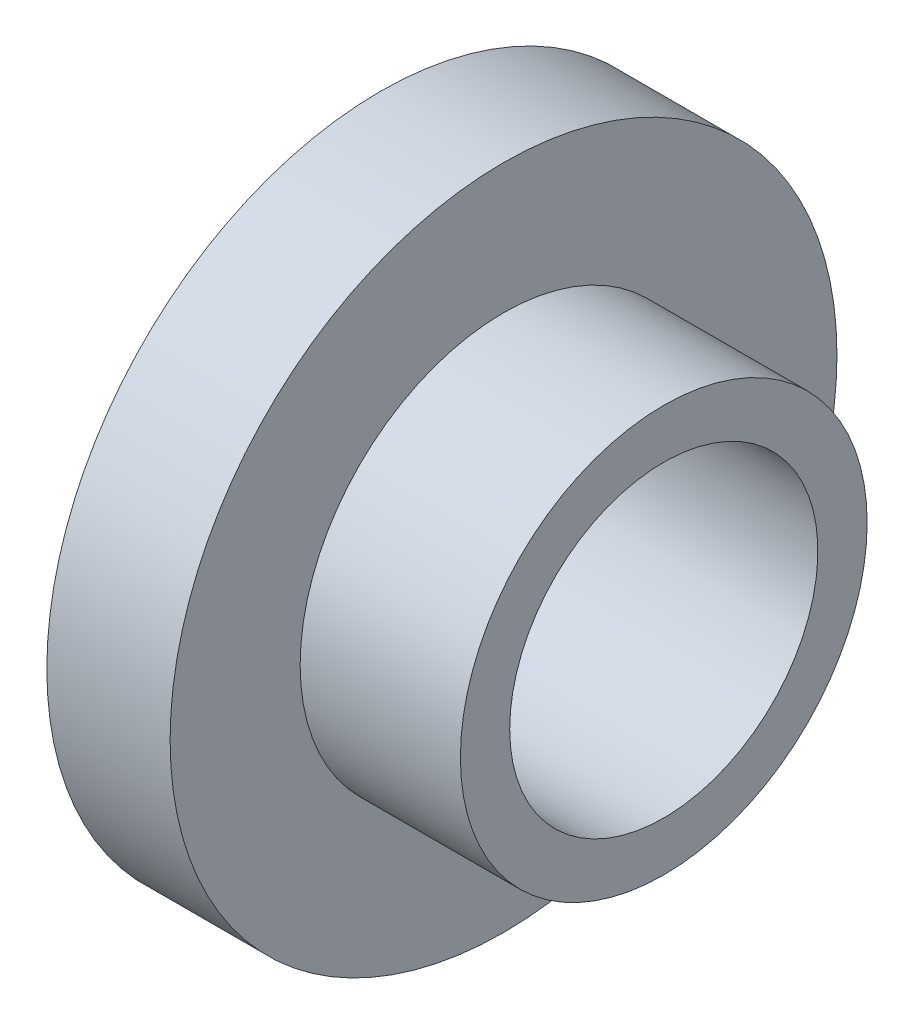
ISO-10303-21;
HEADER;
FILE_DESCRIPTION(('STEP AP214'),'2;1');
FILE_NAME('part.step','',(''),(''),'','','');
FILE_SCHEMA(('AUTOMOTIVE_DESIGN { 1 0 10303 214 1 1 1 1 }'));
ENDSEC;
DATA;
#1=APPLICATION_CONTEXT('core data for automotive mechanical design processes');
#2=APPLICATION_PROTOCOL_DEFINITION('international standard','automotive_design',2000,#1);
#3=PRODUCT_CONTEXT('',#1,'mechanical');
#4=PRODUCT('Part','Part','',(#3));
#5=PRODUCT_RELATED_PRODUCT_CATEGORY('part','',(#4));
#6=PRODUCT_DEFINITION_FORMATION('','',#4);
#7=PRODUCT_DEFINITION_CONTEXT('part definition',#1,'design');
#8=PRODUCT_DEFINITION('design','',#6,#7);
#9=PRODUCT_DEFINITION_SHAPE('','',#8);
#10=(LENGTH_UNIT() NAMED_UNIT(*) SI_UNIT(.MILLI.,.METRE.));
#11=(NAMED_UNIT(*) PLANE_ANGLE_UNIT() SI_UNIT($,.RADIAN.));
#12=(NAMED_UNIT(*) SI_UNIT($,.STERADIAN.) SOLID_ANGLE_UNIT());
#13=UNCERTAINTY_MEASURE_WITH_UNIT(LENGTH_MEASURE(1.E-05),#10,'distance_accuracy_value','');
#14=(GEOMETRIC_REPRESENTATION_CONTEXT(3) GLOBAL_UNCERTAINTY_ASSIGNED_CONTEXT((#13)) GLOBAL_UNIT_ASSIGNED_CONTEXT((#10,
#11,#12)) REPRESENTATION_CONTEXT('',''));
#15=CARTESIAN_POINT('',(0.,0.,0.));
#16=DIRECTION('',(0.,0.,1.));
#17=DIRECTION('',(1.,0.,0.));
#18=AXIS2_PLACEMENT_3D('',#15,#16,#17);
#19=CARTESIAN_POINT('',(5.,0.,0.));
#20=DIRECTION('',(-1.,0.,0.));
#21=DIRECTION('',(0.,0.,1.));
#22=AXIS2_PLACEMENT_3D('',#19,#20,#21);
#23=CYLINDRICAL_SURFACE('',#22,16.5);
#24=CARTESIAN_POINT('',(5.,0.,0.));
#25=DIRECTION('',(-1.,0.,0.));
#26=DIRECTION('',(0.,0.,1.));
#27=AXIS2_PLACEMENT_3D('',#24,#25,#26);
#28=CIRCLE('',#27,16.5);
#29=CARTESIAN_POINT('',(5.,0.,16.5));
#30=VERTEX_POINT('',#29);
#31=EDGE_CURVE('E38',#30,#30,#28,.T.);
#32=ORIENTED_EDGE('',*,*,#31,.F.);
#33=EDGE_LOOP('',(#32));
#34=FACE_BOUND('',#33,.T.);
#35=CARTESIAN_POINT('',(18.,0.,0.));
#36=DIRECTION('',(-1.,0.,0.));
#37=DIRECTION('',(0.,0.,1.));
#38=AXIS2_PLACEMENT_3D('',#35,#36,#37);
#39=CIRCLE('',#38,16.5);
#40=CARTESIAN_POINT('',(18.,0.,16.5));
#41=VERTEX_POINT('',#40);
#42=EDGE_CURVE('E16',#41,#41,#39,.F.);
#43=ORIENTED_EDGE('',*,*,#42,.F.);
#44=EDGE_LOOP('',(#43));
#45=FACE_BOUND('',#44,.T.);
#46=ADVANCED_FACE('F13',(#34,#45),#23,.T.);
#47=CARTESIAN_POINT('',(18.,16.5,16.6980021082497));
#48=DIRECTION('',(1.,0.,0.));
#49=DIRECTION('',(0.,-1.,0.));
#50=AXIS2_PLACEMENT_3D('',#47,#48,#49);
#51=PLANE('',#50);
#52=CARTESIAN_POINT('',(18.,0.,0.));
#53=DIRECTION('',(-1.,0.,0.));
#54=DIRECTION('',(0.,0.,1.));
#55=AXIS2_PLACEMENT_3D('',#52,#53,#54);
#56=CIRCLE('',#55,12.5);
#57=CARTESIAN_POINT('',(18.,0.,12.5));
#58=VERTEX_POINT('',#57);
#59=EDGE_CURVE('E36',#58,#58,#56,.F.);
#60=ORIENTED_EDGE('',*,*,#59,.F.);
#61=EDGE_LOOP('',(#60));
#62=FACE_BOUND('',#61,.T.);
#63=ORIENTED_EDGE('',*,*,#42,.T.);
#64=EDGE_LOOP('',(#63));
#65=FACE_BOUND('',#64,.T.);
#66=ADVANCED_FACE('F45',(#62,#65),#51,.T.);
#67=CARTESIAN_POINT('',(5.,27.05,27.3746010541539));
#68=DIRECTION('',(1.,0.,0.));
#69=DIRECTION('',(0.,-1.,0.));
#70=AXIS2_PLACEMENT_3D('',#67,#68,#69);
#71=PLANE('',#70);
#72=ORIENTED_EDGE('',*,*,#31,.T.);
#73=EDGE_LOOP('',(#72));
#74=FACE_BOUND('',#73,.T.);
#75=CARTESIAN_POINT('',(5.,0.,0.));
#76=DIRECTION('',(-1.,0.,0.));
#77=DIRECTION('',(0.,0.,1.));
#78=AXIS2_PLACEMENT_3D('',#75,#76,#77);
#79=CIRCLE('',#78,27.05);
#80=CARTESIAN_POINT('',(5.,0.,27.05));
#81=VERTEX_POINT('',#80);
#82=EDGE_CURVE('E33',#81,#81,#79,.T.);
#83=ORIENTED_EDGE('',*,*,#82,.F.);
#84=EDGE_LOOP('',(#83));
#85=FACE_BOUND('',#84,.T.);
#86=ADVANCED_FACE('F53',(#74,#85),#71,.T.);
#87=CARTESIAN_POINT('',(18.,0.,0.));
#88=DIRECTION('',(-1.,0.,0.));
#89=DIRECTION('',(0.,0.,1.));
#90=AXIS2_PLACEMENT_3D('',#87,#88,#89);
#91=CYLINDRICAL_SURFACE('',#90,12.5);
#92=ORIENTED_EDGE('',*,*,#59,.T.);
#93=EDGE_LOOP('',(#92));
#94=FACE_BOUND('',#93,.T.);
#95=CARTESIAN_POINT('',(0.,0.,0.));
#96=DIRECTION('',(-1.,0.,0.));
#97=DIRECTION('',(0.,0.,1.));
#98=AXIS2_PLACEMENT_3D('',#95,#96,#97);
#99=CIRCLE('',#98,12.5);
#100=CARTESIAN_POINT('',(0.,0.,12.5));
#101=VERTEX_POINT('',#100);
#102=EDGE_CURVE('E30',#101,#101,#99,.F.);
#103=ORIENTED_EDGE('',*,*,#102,.F.);
#104=EDGE_LOOP('',(#103));
#105=FACE_BOUND('',#104,.T.);
#106=ADVANCED_FACE('F73',(#94,#105),#91,.F.);
#107=CARTESIAN_POINT('',(-5.,0.,0.));
#108=DIRECTION('',(-1.,0.,0.));
#109=DIRECTION('',(0.,0.,1.));
#110=AXIS2_PLACEMENT_3D('',#107,#108,#109);
#111=CYLINDRICAL_SURFACE('',#110,27.05);
#112=CARTESIAN_POINT('',(-5.,0.,0.));
#113=DIRECTION('',(-1.,0.,0.));
#114=DIRECTION('',(0.,0.,1.));
#115=AXIS2_PLACEMENT_3D('',#112,#113,#114);
#116=CIRCLE('',#115,27.05);
#117=CARTESIAN_POINT('',(-5.,0.,27.05));
#118=VERTEX_POINT('',#117);
#119=EDGE_CURVE('E25',#118,#118,#116,.T.);
#120=ORIENTED_EDGE('',*,*,#119,.F.);
#121=EDGE_LOOP('',(#120));
#122=FACE_BOUND('',#121,.T.);
#123=ORIENTED_EDGE('',*,*,#82,.T.);
#124=EDGE_LOOP('',(#123));
#125=FACE_BOUND('',#124,.T.);
#126=ADVANCED_FACE('F69',(#122,#125),#111,.T.);
#127=CARTESIAN_POINT('',(0.,12.5,12.6500021083112));
#128=DIRECTION('',(1.,0.,0.));
#129=DIRECTION('',(0.,-1.,0.));
#130=AXIS2_PLACEMENT_3D('',#127,#128,#129);
#131=PLANE('',#130);
#132=CARTESIAN_POINT('',(0.,0.,0.));
#133=DIRECTION('',(-1.,0.,0.));
#134=DIRECTION('',(0.,0.,1.));
#135=AXIS2_PLACEMENT_3D('',#132,#133,#134);
#136=CIRCLE('',#135,11.1666666666667);
#137=CARTESIAN_POINT('',(0.,0.,11.1666666666667));
#138=VERTEX_POINT('',#137);
#139=EDGE_CURVE('E20',#138,#138,#136,.F.);
#140=ORIENTED_EDGE('',*,*,#139,.F.);
#141=EDGE_LOOP('',(#140));
#142=FACE_BOUND('',#141,.T.);
#143=ORIENTED_EDGE('',*,*,#102,.T.);
#144=EDGE_LOOP('',(#143));
#145=FACE_BOUND('',#144,.T.);
#146=ADVANCED_FACE('F63',(#142,#145),#131,.T.);
#147=CARTESIAN_POINT('',(-5.,-27.05,27.3746010541544));
#148=DIRECTION('',(-1.,0.,0.));
#149=DIRECTION('',(0.,1.,0.));
#150=AXIS2_PLACEMENT_3D('',#147,#148,#149);
#151=PLANE('',#150);
#152=CARTESIAN_POINT('',(-5.,0.,0.));
#153=DIRECTION('',(-1.,0.,0.));
#154=DIRECTION('',(0.,0.,1.));
#155=AXIS2_PLACEMENT_3D('',#152,#153,#154);
#156=CIRCLE('',#155,11.1666666666667);
#157=CARTESIAN_POINT('',(-5.,0.,11.1666666666667));
#158=VERTEX_POINT('',#157);
#159=EDGE_CURVE('E8',#158,#158,#156,.T.);
#160=ORIENTED_EDGE('',*,*,#159,.F.);
#161=EDGE_LOOP('',(#160));
#162=FACE_BOUND('',#161,.T.);
#163=ORIENTED_EDGE('',*,*,#119,.T.);
#164=EDGE_LOOP('',(#163));
#165=FACE_BOUND('',#164,.T.);
#166=ADVANCED_FACE('F57',(#162,#165),#151,.T.);
#167=CARTESIAN_POINT('',(0.,0.,0.));
#168=DIRECTION('',(-1.,0.,0.));
#169=DIRECTION('',(0.,0.,1.));
#170=AXIS2_PLACEMENT_3D('',#167,#168,#169);
#171=CYLINDRICAL_SURFACE('',#170,11.1666666666667);
#172=ORIENTED_EDGE('',*,*,#139,.T.);
#173=EDGE_LOOP('',(#172));
#174=FACE_BOUND('',#173,.T.);
#175=ORIENTED_EDGE('',*,*,#159,.T.);
#176=EDGE_LOOP('',(#175));
#177=FACE_BOUND('',#176,.T.);
#178=ADVANCED_FACE('F55',(#174,#177),#171,.F.);
#179=CLOSED_SHELL('',(#46,#66,#86,#106,#126,#146,#166,#178));
#180=MANIFOLD_SOLID_BREP('B1',#179);
#181=ADVANCED_BREP_SHAPE_REPRESENTATION('',(#18,#180),#14);
#182=SHAPE_DEFINITION_REPRESENTATION(#9,#181);
ENDSEC;
END-ISO-10303-21;
